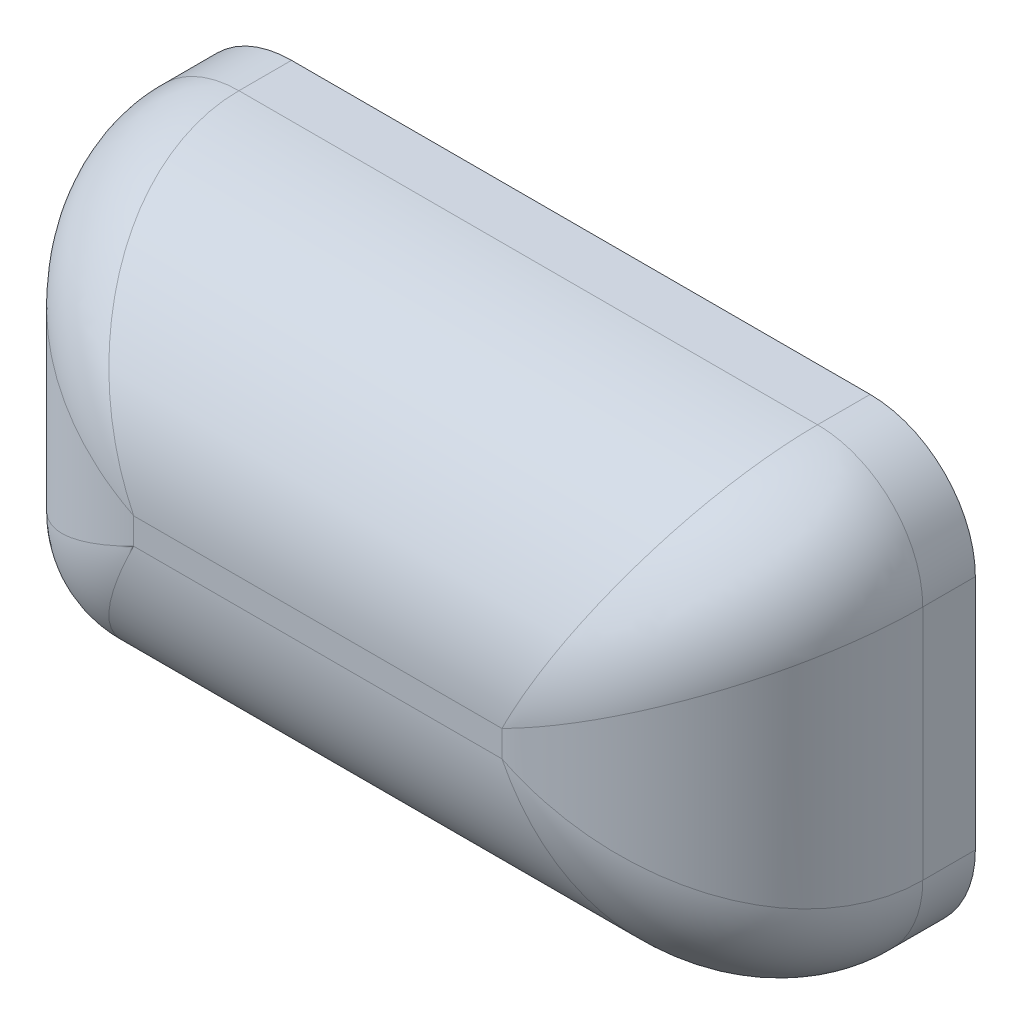
ISO-10303-21;
HEADER;
FILE_DESCRIPTION(('STEP AP214'),'2;1');
FILE_NAME('part.step','',(''),(''),'','','');
FILE_SCHEMA(('AUTOMOTIVE_DESIGN { 1 0 10303 214 1 1 1 1 }'));
ENDSEC;
DATA;
#1=APPLICATION_CONTEXT('core data for automotive mechanical design processes');
#2=APPLICATION_PROTOCOL_DEFINITION('international standard','automotive_design',2000,#1);
#3=PRODUCT_CONTEXT('',#1,'mechanical');
#4=PRODUCT('Part','Part','',(#3));
#5=PRODUCT_RELATED_PRODUCT_CATEGORY('part','',(#4));
#6=PRODUCT_DEFINITION_FORMATION('','',#4);
#7=PRODUCT_DEFINITION_CONTEXT('part definition',#1,'design');
#8=PRODUCT_DEFINITION('design','',#6,#7);
#9=PRODUCT_DEFINITION_SHAPE('','',#8);
#10=(LENGTH_UNIT() NAMED_UNIT(*) SI_UNIT(.MILLI.,.METRE.));
#11=(NAMED_UNIT(*) PLANE_ANGLE_UNIT() SI_UNIT($,.RADIAN.));
#12=(NAMED_UNIT(*) SI_UNIT($,.STERADIAN.) SOLID_ANGLE_UNIT());
#13=UNCERTAINTY_MEASURE_WITH_UNIT(LENGTH_MEASURE(1.E-05),#10,'distance_accuracy_value','');
#14=(GEOMETRIC_REPRESENTATION_CONTEXT(3) GLOBAL_UNCERTAINTY_ASSIGNED_CONTEXT((#13)) GLOBAL_UNIT_ASSIGNED_CONTEXT((#10,
#11,#12)) REPRESENTATION_CONTEXT('',''));
#15=CARTESIAN_POINT('',(0.,0.,0.));
#16=DIRECTION('',(0.,0.,1.));
#17=DIRECTION('',(1.,0.,0.));
#18=AXIS2_PLACEMENT_3D('',#15,#16,#17);
#19=CARTESIAN_POINT('',(-1.5,-0.425,0.5));
#20=DIRECTION('',(0.,0.,1.));
#21=DIRECTION('',(1.,0.,0.));
#22=AXIS2_PLACEMENT_3D('',#19,#20,#21);
#23=PLANE('',#22);
#24=DIRECTION('',(-1.,0.,0.));
#25=VECTOR('',#24,1.);
#26=CARTESIAN_POINT('',(-3.1,-0.025,0.499999999999999));
#27=LINE('',#26,#25);
#28=CARTESIAN_POINT('',(-0.400000000000001,-0.025,0.500000000000001));
#29=VERTEX_POINT('',#28);
#30=CARTESIAN_POINT('',(-1.1,-0.0249999999999999,0.500000000000001));
#31=VERTEX_POINT('',#30);
#32=EDGE_CURVE('E129',#29,#31,#27,.T.);
#33=ORIENTED_EDGE('',*,*,#32,.F.);
#34=DIRECTION('',(0.,-1.,0.));
#35=VECTOR('',#34,1.);
#36=CARTESIAN_POINT('',(-0.4,-2.025,0.500000000000001));
#37=LINE('',#36,#35);
#38=CARTESIAN_POINT('',(-0.4,0.0249999999999999,0.500000000000001));
#39=VERTEX_POINT('',#38);
#40=EDGE_CURVE('E318',#39,#29,#37,.T.);
#41=ORIENTED_EDGE('',*,*,#40,.F.);
#42=DIRECTION('',(1.,0.,0.));
#43=VECTOR('',#42,1.);
#44=CARTESIAN_POINT('',(-3.1,0.025,0.499999999999999));
#45=LINE('',#44,#43);
#46=CARTESIAN_POINT('',(-1.1,0.0249999999999999,0.500000000000001));
#47=VERTEX_POINT('',#46);
#48=EDGE_CURVE('E316',#47,#39,#45,.T.);
#49=ORIENTED_EDGE('',*,*,#48,.F.);
#50=DIRECTION('',(0.,-1.,0.));
#51=VECTOR('',#50,1.);
#52=CARTESIAN_POINT('',(-1.1,-2.025,0.5));
#53=LINE('',#52,#51);
#54=EDGE_CURVE('E119',#31,#47,#53,.F.);
#55=ORIENTED_EDGE('',*,*,#54,.F.);
#56=EDGE_LOOP('',(#33,#41,#49,#55));
#57=FACE_BOUND('',#56,.T.);
#58=ADVANCED_FACE('F16',(#57),#23,.T.);
#59=CARTESIAN_POINT('',(-1.49999999991418,-0.224999999941903,0.0999917140116348));
#60=CARTESIAN_POINT('',(-1.49999919415556,-0.233405015816259,0.0999915401283262));
#61=CARTESIAN_POINT('',(-1.49876372725417,-0.253530032712759,0.0999911493030842));
#62=CARTESIAN_POINT('',(-1.49161799644574,-0.286229829201553,0.099990620588853));
#63=CARTESIAN_POINT('',(-1.4766591112833,-0.321407834183357,0.0999902022547796));
#64=CARTESIAN_POINT('',(-1.45458217313103,-0.3539440927156,0.0999899858511902));
#65=CARTESIAN_POINT('',(-1.42628746452994,-0.381757147736142,0.0999899958166144));
#66=CARTESIAN_POINT('',(-1.39343651419431,-0.403241389005616,0.0999902309940971));
#67=CARTESIAN_POINT('',(-1.35813303362766,-0.417570305539502,0.0999906649583296));
#68=CARTESIAN_POINT('',(-1.32650664483262,-0.423961521613928,0.0999911870746574));
#69=CARTESIAN_POINT('',(-1.3074353834084,-0.424999323359581,0.0999915601873704));
#70=CARTESIAN_POINT('',(-1.2999999999419,-0.424999999914178,0.0999917140116345));
#71=CARTESIAN_POINT('',(-1.50025302512292,-0.225126664316505,0.164490669091044));
#72=CARTESIAN_POINT('',(-1.50034533941391,-0.233579026492574,0.165945359131856));
#73=CARTESIAN_POINT('',(-1.49931617029559,-0.253823660005966,0.169245169715631));
#74=CARTESIAN_POINT('',(-1.49242074076157,-0.286731204179501,0.173793490187356));
#75=CARTESIAN_POINT('',(-1.47761037050898,-0.322126725896793,0.177449434794548));
#76=CARTESIAN_POINT('',(-1.45555239842269,-0.354832632756883,0.179358884439517));
#77=CARTESIAN_POINT('',(-1.42716417837959,-0.382730538250123,0.179270684833113));
#78=CARTESIAN_POINT('',(-1.39413791705956,-0.404185020652501,0.177196776521013));
#79=CARTESIAN_POINT('',(-1.35861461604439,-0.418354068172778,0.173408515497748));
#80=CARTESIAN_POINT('',(-1.3267878395143,-0.424494300946668,0.168924253391945));
#81=CARTESIAN_POINT('',(-1.30760393730408,-0.425334723537882,0.165777562396406));
#82=CARTESIAN_POINT('',(-1.30012666431651,-0.425253025122921,0.164490669091044));
#83=CARTESIAN_POINT('',(-1.46308304877779,-0.206541164142503,0.310324525972511));
#84=CARTESIAN_POINT('',(-1.46114423576723,-0.213209225021531,0.314184146104666));
#85=CARTESIAN_POINT('',(-1.45566483316152,-0.229033780524092,0.322730841705469));
#86=CARTESIAN_POINT('',(-1.44351294191228,-0.254399635153233,0.333926034082604));
#87=CARTESIAN_POINT('',(-1.42605587781078,-0.281785854402158,0.342527908327267));
#88=CARTESIAN_POINT('',(-1.40489051168458,-0.307919650425715,0.346894126416949));
#89=CARTESIAN_POINT('',(-1.38073189284886,-0.331851952641049,0.3466943077515));
#90=CARTESIAN_POINT('',(-1.35445147491298,-0.352721906247782,0.341943789720309));
#91=CARTESIAN_POINT('',(-1.32700262204481,-0.369831250735726,0.333001112514253));
#92=CARTESIAN_POINT('',(-1.30245216848898,-0.381265355250306,0.321913403636554));
#93=CARTESIAN_POINT('',(-1.28743989785446,-0.38636787890251,0.313738839636319));
#94=CARTESIAN_POINT('',(-1.2815411641425,-0.388083048777789,0.310324525972511));
#95=CARTESIAN_POINT('',(-1.30887133386318,-0.129435836921286,0.46432916673947));
#96=CARTESIAN_POINT('',(-1.30568902706735,-0.132483691356448,0.465554679614884));
#97=CARTESIAN_POINT('',(-1.29823293163149,-0.13958362971567,0.468100709099747));
#98=CARTESIAN_POINT('',(-1.28651463633767,-0.150709917036551,0.471030177651814));
#99=CARTESIAN_POINT('',(-1.27384811102796,-0.162857451199449,0.473036975912427));
#100=CARTESIAN_POINT('',(-1.26134931590625,-0.175076413629714,0.47398298432489));
#101=CARTESIAN_POINT('',(-1.24901464693989,-0.187424102942661,0.473940730454586));
#102=CARTESIAN_POINT('',(-1.23680429602916,-0.19993792531226,0.472906775870189));
#103=CARTESIAN_POINT('',(-1.22465998429511,-0.212617495979429,0.470802712284279));
#104=CARTESIAN_POINT('',(-1.21388227425428,-0.223971957848075,0.467867908538213));
#105=CARTESIAN_POINT('',(-1.2071320000543,-0.231056227295944,0.465413249878524));
#106=CARTESIAN_POINT('',(-1.20443583692129,-0.233871333863179,0.46432916673947));
#107=CARTESIAN_POINT('',(-1.16795532990609,-0.0589778280313597,0.499855722018375));
#108=CARTESIAN_POINT('',(-1.16698890202128,-0.0600104390788963,0.499836705219498));
#109=CARTESIAN_POINT('',(-1.16473630200534,-0.0624247114923044,0.499814644099213));
#110=CARTESIAN_POINT('',(-1.1611746148091,-0.0662300044734951,0.49983866627921));
#111=CARTESIAN_POINT('',(-1.15723058042946,-0.070376736279651,0.499891585196762));
#112=CARTESIAN_POINT('',(-1.15321757526823,-0.0744963443401818,0.499929190956469));
#113=CARTESIAN_POINT('',(-1.1491414742022,-0.078567520639559,0.499927312326994));
#114=CARTESIAN_POINT('',(-1.14501862943612,-0.0825745967396719,0.499887100790377));
#115=CARTESIAN_POINT('',(-1.14087062958858,-0.0865128741829891,0.499834663553877));
#116=CARTESIAN_POINT('',(-1.13718560650631,-0.0899590132030398,0.499815431584296));
#117=CARTESIAN_POINT('',(-1.13489129643748,-0.0921004102102414,0.499838908330796));
#118=CARTESIAN_POINT('',(-1.13397782803136,-0.0929553299060879,0.499855722018375));
#119=CARTESIAN_POINT('',(-1.1,-0.0249999999999995,0.500000000000001));
#120=CARTESIAN_POINT('',(-1.1,-0.0249999999999995,0.500000000000001));
#121=CARTESIAN_POINT('',(-1.1,-0.0249999999999995,0.5));
#122=CARTESIAN_POINT('',(-1.1,-0.0249999999999996,0.500000000000001));
#123=CARTESIAN_POINT('',(-1.1,-0.0249999999999997,0.5));
#124=CARTESIAN_POINT('',(-1.1,-0.0249999999999997,0.500000000000001));
#125=CARTESIAN_POINT('',(-1.1,-0.0249999999999998,0.5));
#126=CARTESIAN_POINT('',(-1.1,-0.0249999999999998,0.500000000000001));
#127=CARTESIAN_POINT('',(-1.1,-0.025,0.5));
#128=CARTESIAN_POINT('',(-1.1,-0.025,0.5));
#129=CARTESIAN_POINT('',(-1.1,-0.025,0.5));
#130=CARTESIAN_POINT('',(-1.1,-0.025,0.500000000000001));
#131=B_SPLINE_SURFACE_WITH_KNOTS('',3,3,((#59,#60,#61,#62,#63,#64,#65,#66,#67,#68,#69,#70),(#71,
#72,#73,#74,#75,#76,#77,#78,#79,#80,#81,#82),(#83,#84,#85,#86,#87,#88,#89,#90,#91,#92,#93,#94),
(#95,#96,#97,#98,#99,#100,#101,#102,#103,#104,#105,#106),(#107,#108,#109,#110,#111,#112,#113,
#114,#115,#116,#117,#118),(#119,#120,#121,#122,#123,#124,#125,#126,#127,#128,#129,#130)),
.UNSPECIFIED.,.F.,.F.,.F.,(4,1,1,4),(4,1,1,1,1,1,1,1,1,4),(1.51357884505844,13.002814973814,
27.4835063997114,41.),(0.,0.089142857167281,0.208000000056989,0.326857142946697,
0.445714285836405,0.564571428726113,0.683428571615821,0.802285714505529,0.921142857395237,1.),.UNSPECIFIED.);
#132=CARTESIAN_POINT('',(-1.49999999991418,-0.224999999941903,0.0999917140116348));
#133=CARTESIAN_POINT('',(-1.49999919415556,-0.233405015816259,0.0999915401283262));
#134=CARTESIAN_POINT('',(-1.49876372725417,-0.253530032712759,0.0999911493030842));
#135=CARTESIAN_POINT('',(-1.49161799644574,-0.286229829201553,0.099990620588853));
#136=CARTESIAN_POINT('',(-1.4766591112833,-0.321407834183357,0.0999902022547796));
#137=CARTESIAN_POINT('',(-1.45458217313103,-0.3539440927156,0.0999899858511902));
#138=CARTESIAN_POINT('',(-1.42628746452994,-0.381757147736142,0.0999899958166144));
#139=CARTESIAN_POINT('',(-1.39343651419431,-0.403241389005616,0.0999902309940971));
#140=CARTESIAN_POINT('',(-1.35813303362766,-0.417570305539502,0.0999906649583296));
#141=CARTESIAN_POINT('',(-1.32650664483262,-0.423961521613928,0.0999911870746574));
#142=CARTESIAN_POINT('',(-1.3074353834084,-0.424999323359581,0.0999915601873704));
#143=CARTESIAN_POINT('',(-1.2999999999419,-0.424999999914178,0.0999917140116345));
#144=B_SPLINE_CURVE_WITH_KNOTS('',3,(#132,#133,#134,#135,#136,#137,#138,#139,#140,#141,#142,
#143),.UNSPECIFIED.,.F.,.F.,(4,1,1,1,1,1,1,1,1,4),(0.,0.089142857167281,0.208000000056989,
0.326857142946697,0.445714285836405,0.564571428726113,0.683428571615821,0.802285714505529,
0.921142857395237,1.),.UNSPECIFIED.);
#145=CARTESIAN_POINT('',(-1.29999999997095,-0.424999999957089,0.0999958570058173));
#146=VERTEX_POINT('',#145);
#147=CARTESIAN_POINT('',(-1.49999999995709,-0.224999999970952,0.0999958570058178));
#148=VERTEX_POINT('',#147);
#149=EDGE_CURVE('E111',#146,#148,#144,.F.);
#150=CARTESIAN_POINT('',(-1.2999999999419,-0.424999999914178,0.0999917140116345));
#151=CARTESIAN_POINT('',(-1.30012666431651,-0.425253025122921,0.164490669091044));
#152=CARTESIAN_POINT('',(-1.2815411641425,-0.388083048777789,0.310324525972511));
#153=CARTESIAN_POINT('',(-1.20443583692129,-0.233871333863179,0.46432916673947));
#154=CARTESIAN_POINT('',(-1.13397782803136,-0.0929553299060879,0.499855722018375));
#155=CARTESIAN_POINT('',(-1.1,-0.025,0.500000000000001));
#156=B_SPLINE_CURVE_WITH_KNOTS('',3,(#150,#151,#152,#153,#154,#155),.UNSPECIFIED.,.F.,.F.,(4,1,
1,4),(1.51357884505844,13.002814973814,27.4835063997114,41.),.UNSPECIFIED.);
#157=EDGE_CURVE('E114',#31,#146,#156,.F.);
#158=CARTESIAN_POINT('',(-1.1,-0.0249999999999995,0.500000000000001));
#159=CARTESIAN_POINT('',(-1.16795532990609,-0.0589778280313597,0.499855722018375));
#160=CARTESIAN_POINT('',(-1.30887133386318,-0.129435836921286,0.46432916673947));
#161=CARTESIAN_POINT('',(-1.46308304877779,-0.206541164142503,0.310324525972511));
#162=CARTESIAN_POINT('',(-1.50025302512292,-0.225126664316505,0.164490669091044));
#163=CARTESIAN_POINT('',(-1.49999999991418,-0.224999999941903,0.0999917140116348));
#164=B_SPLINE_CURVE_WITH_KNOTS('',3,(#158,#159,#160,#161,#162,#163),.UNSPECIFIED.,.F.,.F.,(4,1,
1,4),(1.51357884505844,15.030072445347,29.5107638712444,41.),.UNSPECIFIED.);
#165=EDGE_CURVE('E107',#148,#31,#164,.F.);
#166=ORIENTED_EDGE('',*,*,#149,.F.);
#167=ORIENTED_EDGE('',*,*,#157,.F.);
#168=ORIENTED_EDGE('',*,*,#165,.F.);
#169=EDGE_LOOP('',(#166,#167,#168));
#170=FACE_BOUND('',#169,.T.);
#171=ADVANCED_FACE('F110',(#170),#131,.F.);
#172=CARTESIAN_POINT('',(-1.1,-2.025,0.1));
#173=DIRECTION('',(0.,-1.,0.));
#174=DIRECTION('',(0.,0.,-1.));
#175=AXIS2_PLACEMENT_3D('',#172,#173,#174);
#176=CYLINDRICAL_SURFACE('',#175,0.4);
#177=CARTESIAN_POINT('',(-1.49999999991419,0.224999999940078,0.0999917146527918));
#178=CARTESIAN_POINT('',(-1.50028751011467,0.225143449692685,0.167173216519761));
#179=CARTESIAN_POINT('',(-1.46040411772551,0.205202670208011,0.316795537511601));
#180=CARTESIAN_POINT('',(-1.30283956488232,0.126419006606743,0.466862768468096));
#181=CARTESIAN_POINT('',(-1.16441429855593,0.0572079683823875,0.499834816119097));
#182=CARTESIAN_POINT('',(-1.1,0.0249999999999999,0.500000000000001));
#183=B_SPLINE_CURVE_WITH_KNOTS('',3,(#177,#178,#179,#180,#181,#182),.UNSPECIFIED.,.F.,.F.,(4,1,
1,4),(0.,12.25179893932,27.3314507758798,40.4496716861895),.UNSPECIFIED.);
#184=CARTESIAN_POINT('',(-1.49999999995709,0.224999999970039,0.0999958573263965));
#185=VERTEX_POINT('',#184);
#186=EDGE_CURVE('E136',#185,#47,#183,.T.);
#187=ORIENTED_EDGE('',*,*,#186,.F.);
#188=DIRECTION('',(0.,1.,0.));
#189=VECTOR('',#188,1.);
#190=CARTESIAN_POINT('',(-1.5,-0.425,0.100000000000001));
#191=LINE('',#190,#189);
#192=EDGE_CURVE('E133',#148,#185,#191,.T.);
#193=ORIENTED_EDGE('',*,*,#192,.F.);
#194=ORIENTED_EDGE('',*,*,#165,.T.);
#195=ORIENTED_EDGE('',*,*,#54,.T.);
#196=EDGE_LOOP('',(#187,#193,#194,#195));
#197=FACE_BOUND('',#196,.T.);
#198=ADVANCED_FACE('F134',(#197),#176,.T.);
#199=CARTESIAN_POINT('',(-1.1,0.0249999999999999,0.500000000000001));
#200=CARTESIAN_POINT('',(-1.1,0.025,0.500000000000001));
#201=CARTESIAN_POINT('',(-1.1,0.0249999999999999,0.500000000000001));
#202=CARTESIAN_POINT('',(-1.1,0.025,0.500000000000001));
#203=CARTESIAN_POINT('',(-1.1,0.0249999999999999,0.5));
#204=CARTESIAN_POINT('',(-1.1,0.0249999999999999,0.500000000000001));
#205=CARTESIAN_POINT('',(-1.1,0.0249999999999999,0.500000000000001));
#206=CARTESIAN_POINT('',(-1.1,0.0249999999999999,0.5));
#207=CARTESIAN_POINT('',(-1.1,0.0249999999999999,0.500000000000001));
#208=CARTESIAN_POINT('',(-1.1,0.0249999999999999,0.5));
#209=CARTESIAN_POINT('',(-1.1,0.0249999999999999,0.500000000000001));
#210=CARTESIAN_POINT('',(-1.1,0.0249999999999999,0.500000000000001));
#211=CARTESIAN_POINT('',(-1.13220796838239,0.0894142985559339,0.499834816119097));
#212=CARTESIAN_POINT('',(-1.13318885820261,0.0885071397539292,0.499829197470749));
#213=CARTESIAN_POINT('',(-1.1354826368441,0.0863887195192794,0.499838231960424));
#214=CARTESIAN_POINT('',(-1.13909829232993,0.0830260265950773,0.499905831499057));
#215=CARTESIAN_POINT('',(-1.14303760053915,0.0792905884794489,0.499993547988336));
#216=CARTESIAN_POINT('',(-1.14695015799798,0.0754832468146976,0.500049122567008));
#217=CARTESIAN_POINT('',(-1.15081540899789,0.0716131644039277,0.500046417874959));
#218=CARTESIAN_POINT('',(-1.15461673584394,0.0676974456199395,0.499986673639575));
#219=CARTESIAN_POINT('',(-1.15834592612043,0.0637568492469275,0.499898143797536));
#220=CARTESIAN_POINT('',(-1.16159841434373,0.0602554429832241,0.499835959442223));
#221=CARTESIAN_POINT('',(-1.16361180800892,0.058075683166822,0.499829854582282));
#222=CARTESIAN_POINT('',(-1.16441429855593,0.0572079683823875,0.499834816119097));
#223=CARTESIAN_POINT('',(-1.20141900660674,0.227839564882312,0.466862768468096));
#224=CARTESIAN_POINT('',(-1.20437515884296,0.224726029734026,0.467966528329186));
#225=CARTESIAN_POINT('',(-1.21126069352892,0.217445147537748,0.470249050807956));
#226=CARTESIAN_POINT('',(-1.22205145198418,0.20604155233826,0.472849453993546));
#227=CARTESIAN_POINT('',(-1.2338344876745,0.193743588857874,0.47461399468044));
#228=CARTESIAN_POINT('',(-1.24568671777279,0.181619940209165,0.47544037663393));
#229=CARTESIAN_POINT('',(-1.25766232054113,0.169656878813757,0.475403548106281));
#230=CARTESIAN_POINT('',(-1.26980103447914,0.15781290032821,0.474499969118763));
#231=CARTESIAN_POINT('',(-1.2821133844972,0.14603309806801,0.472648558162206));
#232=CARTESIAN_POINT('',(-1.29316595142962,0.135580548040809,0.4700410518413));
#233=CARTESIAN_POINT('',(-1.30008529738157,0.129034049907087,0.467839148267995));
#234=CARTESIAN_POINT('',(-1.30283956488232,0.126419006606743,0.466862768468096));
#235=CARTESIAN_POINT('',(-1.28020267020801,0.385404117725514,0.316795537511601));
#236=CARTESIAN_POINT('',(-1.28676004212225,0.383343656845123,0.320691824256051));
#237=CARTESIAN_POINT('',(-1.30231153277523,0.377607127087724,0.329309145075103));
#238=CARTESIAN_POINT('',(-1.32721598890164,0.365179840902859,0.340569238464696));
#239=CARTESIAN_POINT('',(-1.35411251826802,0.347617896822053,0.349202957905285));
#240=CARTESIAN_POINT('',(-1.3798352319134,0.326552676342615,0.353579665380502));
#241=CARTESIAN_POINT('',(-1.4034976689486,0.302678288717062,0.353379450357838));
#242=CARTESIAN_POINT('',(-1.42428482741915,0.276818364652355,0.34861714626137));
#243=CARTESIAN_POINT('',(-1.44151677225831,0.249862873991569,0.339640007317705));
#244=CARTESIAN_POINT('',(-1.45323142623192,0.225757892008846,0.328485644246291));
#245=CARTESIAN_POINT('',(-1.45858133433079,0.211003480462981,0.320242283689415));
#246=CARTESIAN_POINT('',(-1.46040411772551,0.205202670208011,0.316795537511601));
#247=CARTESIAN_POINT('',(-1.30014344969269,0.425287510114667,0.167173216519761));
#248=CARTESIAN_POINT('',(-1.30859336279171,0.425377401866011,0.168702329516428));
#249=CARTESIAN_POINT('',(-1.32883167504669,0.424339978490649,0.17217050679833));
#250=CARTESIAN_POINT('',(-1.36172718351007,0.417426095083482,0.176948615692548));
#251=CARTESIAN_POINT('',(-1.39710971254701,0.402596812805503,0.180787107352624));
#252=CARTESIAN_POINT('',(-1.42980748617477,0.380527876459997,0.182791090499648));
#253=CARTESIAN_POINT('',(-1.45770654834175,0.352139418278353,0.182698537032731));
#254=CARTESIAN_POINT('',(-1.47917285982091,0.319121909748588,0.180521897795761));
#255=CARTESIAN_POINT('',(-1.49336123207584,0.283611783379288,0.176544305946419));
#256=CARTESIAN_POINT('',(-1.49951909128286,0.251796526030703,0.171833254262924));
#257=CARTESIAN_POINT('',(-1.50036706385706,0.232618555776613,0.168525947389329));
#258=CARTESIAN_POINT('',(-1.50028751011467,0.225143449692685,0.167173216519761));
#259=CARTESIAN_POINT('',(-1.29999999994008,0.424999999914191,0.0999917146527915));
#260=CARTESIAN_POINT('',(-1.30840501581425,0.424999194155308,0.0999915407045387));
#261=CARTESIAN_POINT('',(-1.32853003271034,0.423763727253313,0.099991149733327));
#262=CARTESIAN_POINT('',(-1.36122982919862,0.416617996444013,0.0999906208216249));
#263=CARTESIAN_POINT('',(-1.39640783418011,0.401659111280806,0.0999902023313074));
#264=CARTESIAN_POINT('',(-1.42894409271233,0.379582173128003,0.0999899858468929));
#265=CARTESIAN_POINT('',(-1.45675714773314,0.351287464526669,0.0999899958160393));
#266=CARTESIAN_POINT('',(-1.47824138900317,0.318436514191092,0.0999902310813589));
#267=CARTESIAN_POINT('',(-1.49257030553785,0.283133033624783,0.0999906652076737));
#268=CARTESIAN_POINT('',(-1.49896152161313,0.251506644830246,0.0999911875190081));
#269=CARTESIAN_POINT('',(-1.49999932335936,0.23243538340641,0.0999915607710755));
#270=CARTESIAN_POINT('',(-1.49999999991419,0.224999999940078,0.0999917146527918));
#271=B_SPLINE_SURFACE_WITH_KNOTS('',3,3,((#199,#200,#201,#202,#203,#204,#205,#206,#207,#208,
#209,#210),(#211,#212,#213,#214,#215,#216,#217,#218,#219,#220,#221,#222),(#223,#224,#225,#226,
#227,#228,#229,#230,#231,#232,#233,#234),(#235,#236,#237,#238,#239,#240,#241,#242,#243,#244,
#245,#246),(#247,#248,#249,#250,#251,#252,#253,#254,#255,#256,#257,#258),(#259,#260,#261,#262,
#263,#264,#265,#266,#267,#268,#269,#270)),.UNSPECIFIED.,.F.,.F.,.F.,(4,1,1,4),(4,1,1,1,1,1,1,1,
1,4),(0.,13.1182209103097,28.1978727468695,40.4496716861895),(0.,0.0891428571672772,
0.20800000005698,0.326857142946683,0.445714285836386,0.564571428726089,0.683428571615792,
0.802285714505495,0.921142857395198,1.),.UNSPECIFIED.);
#272=CARTESIAN_POINT('',(-1.29999999994008,0.424999999914191,0.0999917146527915));
#273=CARTESIAN_POINT('',(-1.30840501581425,0.424999194155308,0.0999915407045387));
#274=CARTESIAN_POINT('',(-1.32853003271034,0.423763727253313,0.099991149733327));
#275=CARTESIAN_POINT('',(-1.36122982919862,0.416617996444013,0.0999906208216249));
#276=CARTESIAN_POINT('',(-1.39640783418011,0.401659111280806,0.0999902023313074));
#277=CARTESIAN_POINT('',(-1.42894409271233,0.379582173128003,0.0999899858468929));
#278=CARTESIAN_POINT('',(-1.45675714773314,0.351287464526669,0.0999899958160393));
#279=CARTESIAN_POINT('',(-1.47824138900317,0.318436514191092,0.0999902310813589));
#280=CARTESIAN_POINT('',(-1.49257030553785,0.283133033624783,0.0999906652076737));
#281=CARTESIAN_POINT('',(-1.49896152161313,0.251506644830246,0.0999911875190081));
#282=CARTESIAN_POINT('',(-1.49999932335936,0.23243538340641,0.0999915607710755));
#283=CARTESIAN_POINT('',(-1.49999999991419,0.224999999940078,0.0999917146527918));
#284=B_SPLINE_CURVE_WITH_KNOTS('',3,(#272,#273,#274,#275,#276,#277,#278,#279,#280,#281,#282,
#283),.UNSPECIFIED.,.F.,.F.,(4,1,1,1,1,1,1,1,1,4),(0.,0.0891428571672772,0.20800000005698,
0.326857142946683,0.445714285836386,0.564571428726089,0.683428571615792,0.802285714505495,
0.921142857395198,1.),.UNSPECIFIED.);
#285=CARTESIAN_POINT('',(-1.29999999997004,0.424999999957096,0.0999958573263963));
#286=VERTEX_POINT('',#285);
#287=EDGE_CURVE('E312',#185,#286,#284,.F.);
#288=CARTESIAN_POINT('',(-1.1,0.0249999999999999,0.500000000000001));
#289=CARTESIAN_POINT('',(-1.13220796838239,0.0894142985559339,0.499834816119097));
#290=CARTESIAN_POINT('',(-1.20141900660674,0.227839564882312,0.466862768468096));
#291=CARTESIAN_POINT('',(-1.28020267020801,0.385404117725514,0.316795537511601));
#292=CARTESIAN_POINT('',(-1.30014344969269,0.425287510114667,0.167173216519761));
#293=CARTESIAN_POINT('',(-1.29999999994008,0.424999999914191,0.0999917146527915));
#294=B_SPLINE_CURVE_WITH_KNOTS('',3,(#288,#289,#290,#291,#292,#293),.UNSPECIFIED.,.F.,.F.,(4,1,
1,4),(0.,13.1182209103097,28.1978727468695,40.4496716861895),.UNSPECIFIED.);
#295=EDGE_CURVE('E294',#286,#47,#294,.F.);
#296=ORIENTED_EDGE('',*,*,#287,.F.);
#297=ORIENTED_EDGE('',*,*,#186,.T.);
#298=ORIENTED_EDGE('',*,*,#295,.F.);
#299=EDGE_LOOP('',(#296,#297,#298));
#300=FACE_BOUND('',#299,.T.);
#301=ADVANCED_FACE('F257',(#300),#271,.T.);
#302=CARTESIAN_POINT('',(-3.1,0.025,0.0999999999999991));
#303=DIRECTION('',(1.,0.,0.));
#304=DIRECTION('',(0.,0.,-1.));
#305=AXIS2_PLACEMENT_3D('',#302,#303,#304);
#306=CYLINDRICAL_SURFACE('',#305,0.4);
#307=CARTESIAN_POINT('',(-0.200000000059922,0.424999999914191,0.0999917146527922));
#308=CARTESIAN_POINT('',(-0.199856550307314,0.425287510114666,0.167173216519803));
#309=CARTESIAN_POINT('',(-0.219797329792008,0.385404117725478,0.316795537511685));
#310=CARTESIAN_POINT('',(-0.298580993393295,0.227839564882234,0.466862768468126));
#311=CARTESIAN_POINT('',(-0.367792031617634,0.0894142985558964,0.499834816119097));
#312=CARTESIAN_POINT('',(-0.4,0.0249999999999999,0.500000000000001));
#313=B_SPLINE_CURVE_WITH_KNOTS('',3,(#307,#308,#309,#310,#311,#312),.UNSPECIFIED.,.F.,.F.,(4,1,
1,4),(0.,12.2517989393276,27.3314507758878,40.4496716861895),.UNSPECIFIED.);
#314=CARTESIAN_POINT('',(-0.200000000029961,0.424999999957096,0.0999958573263967));
#315=VERTEX_POINT('',#314);
#316=EDGE_CURVE('E281',#315,#39,#313,.T.);
#317=ORIENTED_EDGE('',*,*,#316,.F.);
#318=DIRECTION('',(1.,0.,0.));
#319=VECTOR('',#318,1.);
#320=CARTESIAN_POINT('',(0.,0.425,0.100000000000001));
#321=LINE('',#320,#319);
#322=EDGE_CURVE('E243',#286,#315,#321,.T.);
#323=ORIENTED_EDGE('',*,*,#322,.F.);
#324=ORIENTED_EDGE('',*,*,#295,.T.);
#325=ORIENTED_EDGE('',*,*,#48,.T.);
#326=EDGE_LOOP('',(#317,#323,#324,#325));
#327=FACE_BOUND('',#326,.T.);
#328=ADVANCED_FACE('F256',(#327),#306,.T.);
#329=CARTESIAN_POINT('',(-0.4,0.0249999999999999,0.500000000000001));
#330=CARTESIAN_POINT('',(-0.4,0.0249999999999999,0.500000000000001));
#331=CARTESIAN_POINT('',(-0.400000000000001,0.0249999999999999,0.500000000000001));
#332=CARTESIAN_POINT('',(-0.4,0.0249999999999999,0.500000000000001));
#333=CARTESIAN_POINT('',(-0.400000000000001,0.0249999999999999,0.500000000000001));
#334=CARTESIAN_POINT('',(-0.4,0.025,0.500000000000001));
#335=CARTESIAN_POINT('',(-0.400000000000001,0.0249999999999999,0.500000000000001));
#336=CARTESIAN_POINT('',(-0.399999999999999,0.0249999999999999,0.500000000000001));
#337=CARTESIAN_POINT('',(-0.400000000000001,0.0249999999999999,0.500000000000001));
#338=CARTESIAN_POINT('',(-0.399999999999999,0.0249999999999999,0.500000000000001));
#339=CARTESIAN_POINT('',(-0.4,0.0249999999999999,0.500000000000001));
#340=CARTESIAN_POINT('',(-0.4,0.0249999999999999,0.500000000000001));
#341=CARTESIAN_POINT('',(-0.335585701444106,0.0572079683823684,0.499834816119098));
#342=CARTESIAN_POINT('',(-0.33649286024611,0.0581888582025889,0.49982919747075));
#343=CARTESIAN_POINT('',(-0.338611280480759,0.0604826368440771,0.499838231960425));
#344=CARTESIAN_POINT('',(-0.341973973404959,0.0640982923299023,0.499905831499059));
#345=CARTESIAN_POINT('',(-0.345709411520584,0.0680376005391256,0.499993547988337));
#346=CARTESIAN_POINT('',(-0.349516753185335,0.0719501579979502,0.50004912256701));
#347=CARTESIAN_POINT('',(-0.353386835596102,0.0758154089978544,0.500046417874961));
#348=CARTESIAN_POINT('',(-0.357302554380088,0.0796167358439059,0.499986673639578));
#349=CARTESIAN_POINT('',(-0.361243150753098,0.0833459261203948,0.499898143797535));
#350=CARTESIAN_POINT('',(-0.364744557016799,0.0865984143436889,0.499835959442224));
#351=CARTESIAN_POINT('',(-0.3669243168332,0.0886118080088809,0.499829854582281));
#352=CARTESIAN_POINT('',(-0.367792031617634,0.0894142985558964,0.499834816119097));
#353=CARTESIAN_POINT('',(-0.197160435117766,0.126419006606705,0.466862768468125));
#354=CARTESIAN_POINT('',(-0.200273970266051,0.129375158842919,0.467966528329216));
#355=CARTESIAN_POINT('',(-0.207554852462324,0.136260693528887,0.470249050807979));
#356=CARTESIAN_POINT('',(-0.21895844766181,0.14705145198413,0.47284945399357));
#357=CARTESIAN_POINT('',(-0.231256411142191,0.158834487674456,0.474613994680457));
#358=CARTESIAN_POINT('',(-0.243380059790894,0.170686717772723,0.475440376633949));
#359=CARTESIAN_POINT('',(-0.255343121186297,0.182662320541071,0.475403548106297));
#360=CARTESIAN_POINT('',(-0.26718709967184,0.194801034479068,0.474499969118783));
#361=CARTESIAN_POINT('',(-0.278966901932036,0.207113384497131,0.472648558162228));
#362=CARTESIAN_POINT('',(-0.289419451959232,0.218165951429539,0.470041051841325));
#363=CARTESIAN_POINT('',(-0.295965950092952,0.225085297381498,0.467839148268024));
#364=CARTESIAN_POINT('',(-0.298580993393295,0.227839564882234,0.466862768468126));
#365=CARTESIAN_POINT('',(-0.0395958822745233,0.205202670207992,0.316795537511686));
#366=CARTESIAN_POINT('',(-0.0416563431549171,0.211760042122232,0.320691824256133));
#367=CARTESIAN_POINT('',(-0.0473928729123197,0.227311532775205,0.329309145075189));
#368=CARTESIAN_POINT('',(-0.0598201590971877,0.252215988901612,0.340569238464779));
#369=CARTESIAN_POINT('',(-0.0773821031779932,0.279112518267984,0.34920295790537));
#370=CARTESIAN_POINT('',(-0.098447323657433,0.304835231913366,0.353579665380585));
#371=CARTESIAN_POINT('',(-0.12232171128298,0.328497668948547,0.353379450357923));
#372=CARTESIAN_POINT('',(-0.148181635347683,0.349284827419108,0.348617146261454));
#373=CARTESIAN_POINT('',(-0.17513712600846,0.366516772258257,0.339640007317788));
#374=CARTESIAN_POINT('',(-0.199242107991179,0.378231426231886,0.328485644246375));
#375=CARTESIAN_POINT('',(-0.213996519537038,0.383581334330748,0.320242283689498));
#376=CARTESIAN_POINT('',(-0.219797329792008,0.385404117725478,0.316795537511685));
#377=CARTESIAN_POINT('',(0.000287510114666915,0.225143449692685,0.167173216519803));
#378=CARTESIAN_POINT('',(0.000377401866012521,0.233593362791712,0.168702329516473));
#379=CARTESIAN_POINT('',(-0.000660021509350489,0.253831675046695,0.172170506798376));
#380=CARTESIAN_POINT('',(-0.0075739049165172,0.286727183510066,0.176948615692598));
#381=CARTESIAN_POINT('',(-0.0224031871944983,0.322109712547013,0.180787107352677));
#382=CARTESIAN_POINT('',(-0.0444721235400023,0.35480748617477,0.182791090499703));
#383=CARTESIAN_POINT('',(-0.0728605817216469,0.38270654834175,0.182698537032786));
#384=CARTESIAN_POINT('',(-0.105878090251412,0.404172859820909,0.180521897795814));
#385=CARTESIAN_POINT('',(-0.141388216620711,0.418361232075837,0.17654430594647));
#386=CARTESIAN_POINT('',(-0.173203473969296,0.424519091282862,0.17183325426297));
#387=CARTESIAN_POINT('',(-0.192381444223387,0.425367063857063,0.168525947389373));
#388=CARTESIAN_POINT('',(-0.199856550307314,0.425287510114666,0.167173216519803));
#389=CARTESIAN_POINT('',(-8.58087489952197E-11,0.224999999940078,0.0999917146527921));
#390=CARTESIAN_POINT('',(-8.05844691804298E-07,0.233405015814246,0.0999915407045394));
#391=CARTESIAN_POINT('',(-0.00123627274668624,0.253530032710335,0.0999911497333273));
#392=CARTESIAN_POINT('',(-0.00838200355598814,0.286229829198625,0.0999906208216258));
#393=CARTESIAN_POINT('',(-0.0233408887191937,0.321407834180113,0.0999902023313077));
#394=CARTESIAN_POINT('',(-0.0454178268719983,0.353944092712326,0.0999899858468936));
#395=CARTESIAN_POINT('',(-0.07371253547333,0.381757147733139,0.0999899958160396));
#396=CARTESIAN_POINT('',(-0.106563485808909,0.40324138900317,0.0999902310813595));
#397=CARTESIAN_POINT('',(-0.141866966375216,0.417570305537847,0.0999906652076741));
#398=CARTESIAN_POINT('',(-0.173493355169755,0.42396152161313,0.0999911875190083));
#399=CARTESIAN_POINT('',(-0.19256461659359,0.42499932335936,0.0999915607710759));
#400=CARTESIAN_POINT('',(-0.200000000059922,0.424999999914191,0.0999917146527922));
#401=B_SPLINE_SURFACE_WITH_KNOTS('',3,3,((#329,#330,#331,#332,#333,#334,#335,#336,#337,#338,
#339,#340),(#341,#342,#343,#344,#345,#346,#347,#348,#349,#350,#351,#352),(#353,#354,#355,#356,
#357,#358,#359,#360,#361,#362,#363,#364),(#365,#366,#367,#368,#369,#370,#371,#372,#373,#374,
#375,#376),(#377,#378,#379,#380,#381,#382,#383,#384,#385,#386,#387,#388),(#389,#390,#391,#392,
#393,#394,#395,#396,#397,#398,#399,#400)),.UNSPECIFIED.,.F.,.F.,.F.,(4,1,1,4),(4,1,1,1,1,1,1,1,
1,4),(0.,13.1182209103017,28.1978727468619,40.4496716861895),(0.,0.0891428571672772,
0.20800000005698,0.326857142946683,0.445714285836386,0.564571428726089,0.683428571615792,
0.802285714505495,0.921142857395198,1.),.UNSPECIFIED.);
#402=CARTESIAN_POINT('',(-0.4,0.0249999999999999,0.500000000000001));
#403=CARTESIAN_POINT('',(-0.335585701444106,0.0572079683823684,0.499834816119098));
#404=CARTESIAN_POINT('',(-0.197160435117766,0.126419006606705,0.466862768468125));
#405=CARTESIAN_POINT('',(-0.0395958822745233,0.205202670207992,0.316795537511686));
#406=CARTESIAN_POINT('',(0.000287510114666915,0.225143449692685,0.167173216519803));
#407=CARTESIAN_POINT('',(-8.58087489952197E-11,0.224999999940078,0.0999917146527921));
#408=B_SPLINE_CURVE_WITH_KNOTS('',3,(#402,#403,#404,#405,#406,#407),.UNSPECIFIED.,.F.,.F.,(4,1,
1,4),(0.,13.1182209103017,28.1978727468619,40.4496716861895),.UNSPECIFIED.);
#409=CARTESIAN_POINT('',(-4.29043673947788E-11,0.224999999970039,0.0999958573263966));
#410=VERTEX_POINT('',#409);
#411=EDGE_CURVE('E596',#410,#39,#408,.F.);
#412=CARTESIAN_POINT('',(-8.5808748516419E-11,0.224999999940078,0.0999917146527922));
#413=CARTESIAN_POINT('',(-8.05844691803668E-07,0.233405015814246,0.0999915407045395));
#414=CARTESIAN_POINT('',(-0.00123627274668624,0.253530032710335,0.0999911497333274));
#415=CARTESIAN_POINT('',(-0.00838200355598814,0.286229829198625,0.0999906208216259));
#416=CARTESIAN_POINT('',(-0.0233408887191937,0.321407834180113,0.0999902023313078));
#417=CARTESIAN_POINT('',(-0.0454178268719983,0.353944092712326,0.0999899858468937));
#418=CARTESIAN_POINT('',(-0.07371253547333,0.381757147733139,0.0999899958160397));
#419=CARTESIAN_POINT('',(-0.106563485808909,0.40324138900317,0.0999902310813596));
#420=CARTESIAN_POINT('',(-0.141866966375216,0.417570305537847,0.0999906652076742));
#421=CARTESIAN_POINT('',(-0.173493355169755,0.42396152161313,0.0999911875190084));
#422=CARTESIAN_POINT('',(-0.19256461659359,0.42499932335936,0.099991560771076));
#423=CARTESIAN_POINT('',(-0.200000000059922,0.424999999914191,0.0999917146527923));
#424=B_SPLINE_CURVE_WITH_KNOTS('',3,(#412,#413,#414,#415,#416,#417,#418,#419,#420,#421,#422,
#423),.UNSPECIFIED.,.F.,.F.,(4,1,1,1,1,1,1,1,1,4),(0.,0.0891428571672772,0.20800000005698,
0.326857142946683,0.445714285836386,0.564571428726089,0.683428571615792,0.802285714505495,
0.921142857395198,1.),.UNSPECIFIED.);
#425=EDGE_CURVE('E238',#315,#410,#424,.F.);
#426=ORIENTED_EDGE('',*,*,#316,.T.);
#427=ORIENTED_EDGE('',*,*,#411,.F.);
#428=ORIENTED_EDGE('',*,*,#425,.F.);
#429=EDGE_LOOP('',(#426,#427,#428));
#430=FACE_BOUND('',#429,.T.);
#431=ADVANCED_FACE('F245',(#430),#401,.T.);
#432=CARTESIAN_POINT('',(-0.4,-2.025,0.100000000000001));
#433=DIRECTION('',(0.,-1.,0.));
#434=DIRECTION('',(0.,0.,-1.));
#435=AXIS2_PLACEMENT_3D('',#432,#433,#434);
#436=CYLINDRICAL_SURFACE('',#435,0.4);
#437=ORIENTED_EDGE('',*,*,#411,.T.);
#438=ORIENTED_EDGE('',*,*,#40,.T.);
#439=CARTESIAN_POINT('',(-8.58087489952197E-11,-0.224999999940078,0.0999917146527921));
#440=CARTESIAN_POINT('',(0.000287510114666219,-0.225143449692685,0.167173216519766));
#441=CARTESIAN_POINT('',(-0.0395958822744886,-0.20520267020801,0.316795537511608));
#442=CARTESIAN_POINT('',(-0.197160435117694,-0.12641900660674,0.4668627684681));
#443=CARTESIAN_POINT('',(-0.335585701444069,-0.057207968382386,0.499834816119097));
#444=CARTESIAN_POINT('',(-0.4,-0.0249999999999999,0.500000000000001));
#445=B_SPLINE_CURVE_WITH_KNOTS('',3,(#439,#440,#441,#442,#443,#444),.UNSPECIFIED.,.F.,.F.,(4,1,
1,4),(0.,12.2517989393206,27.3314507758803,40.4496716861895),.UNSPECIFIED.);
#446=CARTESIAN_POINT('',(-4.2904354530391E-11,-0.224999999970039,0.0999958573263966));
#447=VERTEX_POINT('',#446);
#448=EDGE_CURVE('E427',#447,#29,#445,.T.);
#449=ORIENTED_EDGE('',*,*,#448,.F.);
#450=DIRECTION('',(0.,1.,0.));
#451=VECTOR('',#450,1.);
#452=CARTESIAN_POINT('',(0.,-0.425,0.100000000000001));
#453=LINE('',#452,#451);
#454=EDGE_CURVE('E405',#410,#447,#453,.F.);
#455=ORIENTED_EDGE('',*,*,#454,.F.);
#456=EDGE_LOOP('',(#437,#438,#449,#455));
#457=FACE_BOUND('',#456,.T.);
#458=ADVANCED_FACE('F177',(#457),#436,.T.);
#459=CARTESIAN_POINT('',(-0.400000000000001,-0.025,0.500000000000001));
#460=CARTESIAN_POINT('',(-0.400000000000001,-0.0250000000000001,0.500000000000001));
#461=CARTESIAN_POINT('',(-0.400000000000001,-0.025,0.500000000000002));
#462=CARTESIAN_POINT('',(-0.4,-0.025,0.500000000000001));
#463=CARTESIAN_POINT('',(-0.400000000000001,-0.025,0.500000000000001));
#464=CARTESIAN_POINT('',(-0.4,-0.025,0.500000000000001));
#465=CARTESIAN_POINT('',(-0.400000000000001,-0.025,0.500000000000002));
#466=CARTESIAN_POINT('',(-0.400000000000001,-0.025,0.500000000000001));
#467=CARTESIAN_POINT('',(-0.4,-0.0249999999999999,0.500000000000001));
#468=CARTESIAN_POINT('',(-0.4,-0.025,0.500000000000001));
#469=CARTESIAN_POINT('',(-0.4,-0.0249999999999999,0.500000000000001));
#470=CARTESIAN_POINT('',(-0.4,-0.0249999999999999,0.500000000000001));
#471=CARTESIAN_POINT('',(-0.367792031617614,-0.0894142985559301,0.499834816119097));
#472=CARTESIAN_POINT('',(-0.366811141797393,-0.0885071397539268,0.49982919747075));
#473=CARTESIAN_POINT('',(-0.364517363155904,-0.0863887195192753,0.499838231960423));
#474=CARTESIAN_POINT('',(-0.360901707670075,-0.0830260265950742,0.499905831499057));
#475=CARTESIAN_POINT('',(-0.356962399460851,-0.0792905884794464,0.499993547988337));
#476=CARTESIAN_POINT('',(-0.353049842002024,-0.0754832468146943,0.500049122567008));
#477=CARTESIAN_POINT('',(-0.349184591002118,-0.0716131644039254,0.500046417874959));
#478=CARTESIAN_POINT('',(-0.345383264156064,-0.0676974456199368,0.499986673639577));
#479=CARTESIAN_POINT('',(-0.341654073879574,-0.0637568492469254,0.499898143797534));
#480=CARTESIAN_POINT('',(-0.338401585656277,-0.0602554429832223,0.499835959442224));
#481=CARTESIAN_POINT('',(-0.336388191991085,-0.0580756831668205,0.499829854582282));
#482=CARTESIAN_POINT('',(-0.335585701444069,-0.057207968382386,0.499834816119097));
#483=CARTESIAN_POINT('',(-0.298580993393261,-0.227839564882308,0.466862768468099));
#484=CARTESIAN_POINT('',(-0.295624841157044,-0.224726029734019,0.467966528329188));
#485=CARTESIAN_POINT('',(-0.288739306471075,-0.217445147537745,0.470249050807959));
#486=CARTESIAN_POINT('',(-0.277948548015828,-0.206041552338255,0.472849453993549));
#487=CARTESIAN_POINT('',(-0.266165512325498,-0.193743588857868,0.474613994680441));
#488=CARTESIAN_POINT('',(-0.254313282227226,-0.181619940209161,0.475440376633932));
#489=CARTESIAN_POINT('',(-0.242337679458874,-0.169656878813753,0.475403548106283));
#490=CARTESIAN_POINT('',(-0.230198965520872,-0.157812900328207,0.474499969118764));
#491=CARTESIAN_POINT('',(-0.217886615502805,-0.146033098068006,0.47264855816221));
#492=CARTESIAN_POINT('',(-0.206834048570392,-0.135580548040806,0.470041051841302));
#493=CARTESIAN_POINT('',(-0.199914702618431,-0.129034049907084,0.467839148267998));
#494=CARTESIAN_POINT('',(-0.197160435117694,-0.12641900660674,0.4668627684681));
#495=CARTESIAN_POINT('',(-0.21979732979199,-0.38540411772551,0.316795537511608));
#496=CARTESIAN_POINT('',(-0.21323995787775,-0.38334365684512,0.320691824256058));
#497=CARTESIAN_POINT('',(-0.197688467224772,-0.377607127087719,0.329309145075109));
#498=CARTESIAN_POINT('',(-0.17278401109836,-0.365179840902855,0.340569238464703));
#499=CARTESIAN_POINT('',(-0.145887481731982,-0.347617896822051,0.349202957905293));
#500=CARTESIAN_POINT('',(-0.120164768086595,-0.326552676342609,0.353579665380508));
#501=CARTESIAN_POINT('',(-0.0965023310514096,-0.302678288717059,0.353379450357845));
#502=CARTESIAN_POINT('',(-0.0757151725808483,-0.276818364652351,0.348617146261377));
#503=CARTESIAN_POINT('',(-0.0584832277417019,-0.249862873991567,0.339640007317711));
#504=CARTESIAN_POINT('',(-0.0467685737680747,-0.225757892008843,0.328485644246298));
#505=CARTESIAN_POINT('',(-0.0414186656692168,-0.21100348046298,0.320242283689423));
#506=CARTESIAN_POINT('',(-0.0395958822744886,-0.20520267020801,0.316795537511608));
#507=CARTESIAN_POINT('',(-0.199856550307316,-0.425287510114667,0.167173216519766));
#508=CARTESIAN_POINT('',(-0.191406637208289,-0.425377401866012,0.168702329516432));
#509=CARTESIAN_POINT('',(-0.171168324953305,-0.424339978490649,0.172170506798335));
#510=CARTESIAN_POINT('',(-0.138272816489935,-0.417426095083483,0.176948615692552));
#511=CARTESIAN_POINT('',(-0.102890287452987,-0.402596812805502,0.180787107352629));
#512=CARTESIAN_POINT('',(-0.0701925138252308,-0.380527876459997,0.182791090499653));
#513=CARTESIAN_POINT('',(-0.0422934516582501,-0.352139418278353,0.182698537032737));
#514=CARTESIAN_POINT('',(-0.0208271401790913,-0.319121909748588,0.180521897795767));
#515=CARTESIAN_POINT('',(-0.00663876792416328,-0.283611783379288,0.176544305946425));
#516=CARTESIAN_POINT('',(-0.00048090871713741,-0.251796526030703,0.171833254262929));
#517=CARTESIAN_POINT('',(0.000367063857062227,-0.232618555776613,0.168525947389333));
#518=CARTESIAN_POINT('',(0.000287510114666219,-0.225143449692685,0.167173216519766));
#519=CARTESIAN_POINT('',(-0.200000000059922,-0.424999999914191,0.0999917146527921));
#520=CARTESIAN_POINT('',(-0.191594984185754,-0.424999194155308,0.0999915407045394));
#521=CARTESIAN_POINT('',(-0.171469967289666,-0.423763727253314,0.0999911497333275));
#522=CARTESIAN_POINT('',(-0.138770170801375,-0.416617996444012,0.0999906208216257));
#523=CARTESIAN_POINT('',(-0.103592165819887,-0.401659111280806,0.0999902023313079));
#524=CARTESIAN_POINT('',(-0.0710559072876738,-0.379582173128002,0.0999899858468936));
#525=CARTESIAN_POINT('',(-0.0432428522668616,-0.35128746452667,0.0999899958160396));
#526=CARTESIAN_POINT('',(-0.0217586109968304,-0.318436514191091,0.0999902310813595));
#527=CARTESIAN_POINT('',(-0.00742969446215284,-0.283133033624784,0.0999906652076741));
#528=CARTESIAN_POINT('',(-0.00103847838687027,-0.251506644830246,0.0999911875190084));
#529=CARTESIAN_POINT('',(-6.76640639726694E-07,-0.232435383406411,0.0999915607710759));
#530=CARTESIAN_POINT('',(-8.58087489952197E-11,-0.224999999940078,0.0999917146527921));
#531=B_SPLINE_SURFACE_WITH_KNOTS('',3,3,((#459,#460,#461,#462,#463,#464,#465,#466,#467,#468,
#469,#470),(#471,#472,#473,#474,#475,#476,#477,#478,#479,#480,#481,#482),(#483,#484,#485,#486,
#487,#488,#489,#490,#491,#492,#493,#494),(#495,#496,#497,#498,#499,#500,#501,#502,#503,#504,
#505,#506),(#507,#508,#509,#510,#511,#512,#513,#514,#515,#516,#517,#518),(#519,#520,#521,#522,
#523,#524,#525,#526,#527,#528,#529,#530)),.UNSPECIFIED.,.F.,.F.,.F.,(4,1,1,4),(4,1,1,1,1,1,1,1,
1,4),(0.,13.1182209103092,28.1978727468689,40.4496716861895),(0.,0.0891428571672772,
0.20800000005698,0.326857142946683,0.445714285836386,0.564571428726089,0.683428571615792,
0.802285714505495,0.921142857395198,1.),.UNSPECIFIED.);
#532=CARTESIAN_POINT('',(-0.400000000000001,-0.025,0.500000000000001));
#533=CARTESIAN_POINT('',(-0.367792031617614,-0.0894142985559301,0.499834816119097));
#534=CARTESIAN_POINT('',(-0.298580993393261,-0.227839564882308,0.466862768468099));
#535=CARTESIAN_POINT('',(-0.21979732979199,-0.38540411772551,0.316795537511608));
#536=CARTESIAN_POINT('',(-0.199856550307316,-0.425287510114667,0.167173216519766));
#537=CARTESIAN_POINT('',(-0.200000000059922,-0.424999999914191,0.0999917146527921));
#538=B_SPLINE_CURVE_WITH_KNOTS('',3,(#532,#533,#534,#535,#536,#537),.UNSPECIFIED.,.F.,.F.,(4,1,
1,4),(0.,13.1182209103092,28.1978727468689,40.4496716861895),.UNSPECIFIED.);
#539=CARTESIAN_POINT('',(-0.200000000029961,-0.424999999957095,0.0999958573263963));
#540=VERTEX_POINT('',#539);
#541=EDGE_CURVE('E70',#540,#29,#538,.F.);
#542=CARTESIAN_POINT('',(-0.200000000059922,-0.424999999914191,0.0999917146527921));
#543=CARTESIAN_POINT('',(-0.191594984185754,-0.424999194155308,0.0999915407045394));
#544=CARTESIAN_POINT('',(-0.171469967289666,-0.423763727253314,0.0999911497333275));
#545=CARTESIAN_POINT('',(-0.138770170801375,-0.416617996444012,0.0999906208216257));
#546=CARTESIAN_POINT('',(-0.103592165819887,-0.401659111280806,0.0999902023313079));
#547=CARTESIAN_POINT('',(-0.0710559072876738,-0.379582173128002,0.0999899858468936));
#548=CARTESIAN_POINT('',(-0.0432428522668616,-0.35128746452667,0.0999899958160396));
#549=CARTESIAN_POINT('',(-0.0217586109968304,-0.318436514191091,0.0999902310813595));
#550=CARTESIAN_POINT('',(-0.00742969446215284,-0.283133033624784,0.0999906652076741));
#551=CARTESIAN_POINT('',(-0.00103847838687027,-0.251506644830246,0.0999911875190084));
#552=CARTESIAN_POINT('',(-6.76640639726694E-07,-0.232435383406411,0.0999915607710759));
#553=CARTESIAN_POINT('',(-8.58087489952197E-11,-0.224999999940078,0.0999917146527921));
#554=B_SPLINE_CURVE_WITH_KNOTS('',3,(#542,#543,#544,#545,#546,#547,#548,#549,#550,#551,#552,
#553),.UNSPECIFIED.,.F.,.F.,(4,1,1,1,1,1,1,1,1,4),(0.,0.0891428571672772,0.20800000005698,
0.326857142946683,0.445714285836386,0.564571428726089,0.683428571615792,0.802285714505495,
0.921142857395198,1.),.UNSPECIFIED.);
#555=EDGE_CURVE('E154',#447,#540,#554,.F.);
#556=ORIENTED_EDGE('',*,*,#541,.F.);
#557=ORIENTED_EDGE('',*,*,#555,.F.);
#558=ORIENTED_EDGE('',*,*,#448,.T.);
#559=EDGE_LOOP('',(#556,#557,#558));
#560=FACE_BOUND('',#559,.T.);
#561=ADVANCED_FACE('F18',(#560),#531,.T.);
#562=CARTESIAN_POINT('',(-3.1,-0.025,0.099999999999999));
#563=DIRECTION('',(-1.,0.,0.));
#564=DIRECTION('',(0.,0.,1.));
#565=AXIS2_PLACEMENT_3D('',#562,#563,#564);
#566=CYLINDRICAL_SURFACE('',#565,0.4);
#567=ORIENTED_EDGE('',*,*,#541,.T.);
#568=ORIENTED_EDGE('',*,*,#32,.T.);
#569=ORIENTED_EDGE('',*,*,#157,.T.);
#570=DIRECTION('',(1.,0.,0.));
#571=VECTOR('',#570,1.);
#572=CARTESIAN_POINT('',(0.,-0.425,0.1));
#573=LINE('',#572,#571);
#574=EDGE_CURVE('E152',#146,#540,#573,.T.);
#575=ORIENTED_EDGE('',*,*,#574,.T.);
#576=EDGE_LOOP('',(#567,#568,#569,#575));
#577=FACE_BOUND('',#576,.T.);
#578=ADVANCED_FACE('F165',(#577),#566,.T.);
#579=CARTESIAN_POINT('',(-1.3,-0.225,-0.700000000000004));
#580=DIRECTION('',(0.,0.,-1.));
#581=DIRECTION('',(0.,1.,0.));
#582=AXIS2_PLACEMENT_3D('',#579,#580,#581);
#583=CYLINDRICAL_SURFACE('',#582,0.2);
#584=DIRECTION('',(0.,0.,1.));
#585=VECTOR('',#584,1.);
#586=CARTESIAN_POINT('',(-1.3,-0.425,0.));
#587=LINE('',#586,#585);
#588=CARTESIAN_POINT('',(-1.3,-0.425,0.));
#589=VERTEX_POINT('',#588);
#590=EDGE_CURVE('E127',#589,#146,#587,.T.);
#591=ORIENTED_EDGE('',*,*,#590,.T.);
#592=ORIENTED_EDGE('',*,*,#149,.T.);
#593=DIRECTION('',(0.,0.,1.));
#594=VECTOR('',#593,1.);
#595=CARTESIAN_POINT('',(-1.5,-0.225,0.));
#596=LINE('',#595,#594);
#597=CARTESIAN_POINT('',(-1.5,-0.225,0.));
#598=VERTEX_POINT('',#597);
#599=EDGE_CURVE('E125',#598,#148,#596,.T.);
#600=ORIENTED_EDGE('',*,*,#599,.F.);
#601=CARTESIAN_POINT('',(-1.3,-0.225,0.));
#602=DIRECTION('',(0.,0.,-1.));
#603=DIRECTION('',(0.,1.,0.));
#604=AXIS2_PLACEMENT_3D('',#601,#602,#603);
#605=CIRCLE('',#604,0.2);
#606=EDGE_CURVE('E23',#589,#598,#605,.T.);
#607=ORIENTED_EDGE('',*,*,#606,.F.);
#608=EDGE_LOOP('',(#591,#592,#600,#607));
#609=FACE_BOUND('',#608,.T.);
#610=ADVANCED_FACE('F123',(#609),#583,.T.);
#611=CARTESIAN_POINT('',(-1.5,-0.425,0.));
#612=DIRECTION('',(-1.,0.,0.));
#613=DIRECTION('',(0.,0.,1.));
#614=AXIS2_PLACEMENT_3D('',#611,#612,#613);
#615=PLANE('',#614);
#616=DIRECTION('',(0.,0.,1.));
#617=VECTOR('',#616,1.);
#618=CARTESIAN_POINT('',(-1.5,0.225,-0.700000000000005));
#619=LINE('',#618,#617);
#620=CARTESIAN_POINT('',(-1.5,0.225,0.));
#621=VERTEX_POINT('',#620);
#622=EDGE_CURVE('E140',#621,#185,#619,.T.);
#623=ORIENTED_EDGE('',*,*,#622,.F.);
#624=DIRECTION('',(0.,1.,0.));
#625=VECTOR('',#624,1.);
#626=CARTESIAN_POINT('',(-1.5,-0.425,0.));
#627=LINE('',#626,#625);
#628=EDGE_CURVE('E144',#598,#621,#627,.T.);
#629=ORIENTED_EDGE('',*,*,#628,.F.);
#630=ORIENTED_EDGE('',*,*,#599,.T.);
#631=ORIENTED_EDGE('',*,*,#192,.T.);
#632=EDGE_LOOP('',(#623,#629,#630,#631));
#633=FACE_BOUND('',#632,.T.);
#634=ADVANCED_FACE('F142',(#633),#615,.T.);
#635=CARTESIAN_POINT('',(-1.3,0.225,-0.700000000000005));
#636=DIRECTION('',(0.,0.,1.));
#637=DIRECTION('',(0.,-1.,0.));
#638=AXIS2_PLACEMENT_3D('',#635,#636,#637);
#639=CYLINDRICAL_SURFACE('',#638,0.2);
#640=DIRECTION('',(0.,0.,1.));
#641=VECTOR('',#640,1.);
#642=CARTESIAN_POINT('',(-1.3,0.425,0.));
#643=LINE('',#642,#641);
#644=CARTESIAN_POINT('',(-1.3,0.425,0.));
#645=VERTEX_POINT('',#644);
#646=EDGE_CURVE('E417',#645,#286,#643,.T.);
#647=ORIENTED_EDGE('',*,*,#646,.F.);
#648=CARTESIAN_POINT('',(-1.3,0.225,0.));
#649=DIRECTION('',(0.,0.,1.));
#650=DIRECTION('',(0.,-1.,0.));
#651=AXIS2_PLACEMENT_3D('',#648,#649,#650);
#652=CIRCLE('',#651,0.2);
#653=EDGE_CURVE('E390',#621,#645,#652,.F.);
#654=ORIENTED_EDGE('',*,*,#653,.F.);
#655=ORIENTED_EDGE('',*,*,#622,.T.);
#656=ORIENTED_EDGE('',*,*,#287,.T.);
#657=EDGE_LOOP('',(#647,#654,#655,#656));
#658=FACE_BOUND('',#657,.T.);
#659=ADVANCED_FACE('F358',(#658),#639,.T.);
#660=CARTESIAN_POINT('',(0.,0.425,0.));
#661=DIRECTION('',(0.,1.,0.));
#662=DIRECTION('',(0.,0.,1.));
#663=AXIS2_PLACEMENT_3D('',#660,#661,#662);
#664=PLANE('',#663);
#665=DIRECTION('',(0.,0.,-1.));
#666=VECTOR('',#665,1.);
#667=CARTESIAN_POINT('',(-0.2,0.425,0.800000000000009));
#668=LINE('',#667,#666);
#669=CARTESIAN_POINT('',(-0.2,0.425,0.));
#670=VERTEX_POINT('',#669);
#671=EDGE_CURVE('E413',#670,#315,#668,.F.);
#672=ORIENTED_EDGE('',*,*,#671,.F.);
#673=DIRECTION('',(-1.,0.,0.));
#674=VECTOR('',#673,1.);
#675=CARTESIAN_POINT('',(0.,0.425,0.));
#676=LINE('',#675,#674);
#677=EDGE_CURVE('E389',#645,#670,#676,.F.);
#678=ORIENTED_EDGE('',*,*,#677,.F.);
#679=ORIENTED_EDGE('',*,*,#646,.T.);
#680=ORIENTED_EDGE('',*,*,#322,.T.);
#681=EDGE_LOOP('',(#672,#678,#679,#680));
#682=FACE_BOUND('',#681,.T.);
#683=ADVANCED_FACE('F219',(#682),#664,.T.);
#684=CARTESIAN_POINT('',(-0.2,0.225,0.800000000000009));
#685=DIRECTION('',(0.,0.,-1.));
#686=DIRECTION('',(-1.,0.,0.));
#687=AXIS2_PLACEMENT_3D('',#684,#685,#686);
#688=CYLINDRICAL_SURFACE('',#687,0.2);
#689=ORIENTED_EDGE('',*,*,#671,.T.);
#690=ORIENTED_EDGE('',*,*,#425,.T.);
#691=DIRECTION('',(0.,0.,-1.));
#692=VECTOR('',#691,1.);
#693=CARTESIAN_POINT('',(0.,0.225,0.500000000000001));
#694=LINE('',#693,#692);
#695=CARTESIAN_POINT('',(0.,0.225,0.));
#696=VERTEX_POINT('',#695);
#697=EDGE_CURVE('E408',#696,#410,#694,.F.);
#698=ORIENTED_EDGE('',*,*,#697,.F.);
#699=CARTESIAN_POINT('',(-0.2,0.225,0.));
#700=DIRECTION('',(0.,0.,-1.));
#701=DIRECTION('',(-1.,0.,0.));
#702=AXIS2_PLACEMENT_3D('',#699,#700,#701);
#703=CIRCLE('',#702,0.2);
#704=EDGE_CURVE('E384',#670,#696,#703,.T.);
#705=ORIENTED_EDGE('',*,*,#704,.F.);
#706=EDGE_LOOP('',(#689,#690,#698,#705));
#707=FACE_BOUND('',#706,.T.);
#708=ADVANCED_FACE('F214',(#707),#688,.T.);
#709=CARTESIAN_POINT('',(0.,-0.425,0.500000000000001));
#710=DIRECTION('',(1.,0.,0.));
#711=DIRECTION('',(0.,0.,-1.));
#712=AXIS2_PLACEMENT_3D('',#709,#710,#711);
#713=PLANE('',#712);
#714=ORIENTED_EDGE('',*,*,#697,.T.);
#715=ORIENTED_EDGE('',*,*,#454,.T.);
#716=DIRECTION('',(0.,0.,1.));
#717=VECTOR('',#716,1.);
#718=CARTESIAN_POINT('',(0.,-0.225,0.800000000000008));
#719=LINE('',#718,#717);
#720=CARTESIAN_POINT('',(0.,-0.225,0.));
#721=VERTEX_POINT('',#720);
#722=EDGE_CURVE('E403',#721,#447,#719,.T.);
#723=ORIENTED_EDGE('',*,*,#722,.F.);
#724=DIRECTION('',(0.,1.,0.));
#725=VECTOR('',#724,1.);
#726=CARTESIAN_POINT('',(0.,-0.425,0.));
#727=LINE('',#726,#725);
#728=EDGE_CURVE('E382',#696,#721,#727,.F.);
#729=ORIENTED_EDGE('',*,*,#728,.F.);
#730=EDGE_LOOP('',(#714,#715,#723,#729));
#731=FACE_BOUND('',#730,.T.);
#732=ADVANCED_FACE('F210',(#731),#713,.T.);
#733=CARTESIAN_POINT('',(-0.2,-0.225,0.800000000000008));
#734=DIRECTION('',(0.,0.,1.));
#735=DIRECTION('',(1.,0.,0.));
#736=AXIS2_PLACEMENT_3D('',#733,#734,#735);
#737=CYLINDRICAL_SURFACE('',#736,0.2);
#738=DIRECTION('',(0.,0.,1.));
#739=VECTOR('',#738,1.);
#740=CARTESIAN_POINT('',(-0.2,-0.425,0.));
#741=LINE('',#740,#739);
#742=CARTESIAN_POINT('',(-0.2,-0.425,0.));
#743=VERTEX_POINT('',#742);
#744=EDGE_CURVE('E38',#540,#743,#741,.F.);
#745=ORIENTED_EDGE('',*,*,#744,.T.);
#746=CARTESIAN_POINT('',(-0.2,-0.225,0.));
#747=DIRECTION('',(0.,0.,1.));
#748=DIRECTION('',(1.,0.,0.));
#749=AXIS2_PLACEMENT_3D('',#746,#747,#748);
#750=CIRCLE('',#749,0.2);
#751=EDGE_CURVE('E29',#721,#743,#750,.F.);
#752=ORIENTED_EDGE('',*,*,#751,.F.);
#753=ORIENTED_EDGE('',*,*,#722,.T.);
#754=ORIENTED_EDGE('',*,*,#555,.T.);
#755=EDGE_LOOP('',(#745,#752,#753,#754));
#756=FACE_BOUND('',#755,.T.);
#757=ADVANCED_FACE('F199',(#756),#737,.T.);
#758=CARTESIAN_POINT('',(0.,-0.425,0.));
#759=DIRECTION('',(0.,1.,0.));
#760=DIRECTION('',(0.,0.,1.));
#761=AXIS2_PLACEMENT_3D('',#758,#759,#760);
#762=PLANE('',#761);
#763=DIRECTION('',(-1.,0.,0.));
#764=VECTOR('',#763,1.);
#765=CARTESIAN_POINT('',(0.,-0.425,0.));
#766=LINE('',#765,#764);
#767=EDGE_CURVE('E10',#743,#589,#766,.T.);
#768=ORIENTED_EDGE('',*,*,#767,.F.);
#769=ORIENTED_EDGE('',*,*,#744,.F.);
#770=ORIENTED_EDGE('',*,*,#574,.F.);
#771=ORIENTED_EDGE('',*,*,#590,.F.);
#772=EDGE_LOOP('',(#768,#769,#770,#771));
#773=FACE_BOUND('',#772,.T.);
#774=ADVANCED_FACE('F209',(#773),#762,.F.);
#775=CARTESIAN_POINT('',(0.,-0.425,0.));
#776=DIRECTION('',(0.,0.,-1.));
#777=DIRECTION('',(-1.,0.,0.));
#778=AXIS2_PLACEMENT_3D('',#775,#776,#777);
#779=PLANE('',#778);
#780=ORIENTED_EDGE('',*,*,#751,.T.);
#781=ORIENTED_EDGE('',*,*,#767,.T.);
#782=ORIENTED_EDGE('',*,*,#606,.T.);
#783=ORIENTED_EDGE('',*,*,#628,.T.);
#784=ORIENTED_EDGE('',*,*,#653,.T.);
#785=ORIENTED_EDGE('',*,*,#677,.T.);
#786=ORIENTED_EDGE('',*,*,#704,.T.);
#787=ORIENTED_EDGE('',*,*,#728,.T.);
#788=EDGE_LOOP('',(#780,#781,#782,#783,#784,#785,#786,#787));
#789=FACE_BOUND('',#788,.T.);
#790=ADVANCED_FACE('F371',(#789),#779,.T.);
#791=CLOSED_SHELL('',(#58,#171,#198,#301,#328,#431,#458,#561,#578,#610,#634,#659,#683,#708,#732,
#757,#774,#790));
#792=MANIFOLD_SOLID_BREP('B1',#791);
#793=ADVANCED_BREP_SHAPE_REPRESENTATION('',(#18,#792),#14);
#794=SHAPE_DEFINITION_REPRESENTATION(#9,#793);
ENDSEC;
END-ISO-10303-21;
